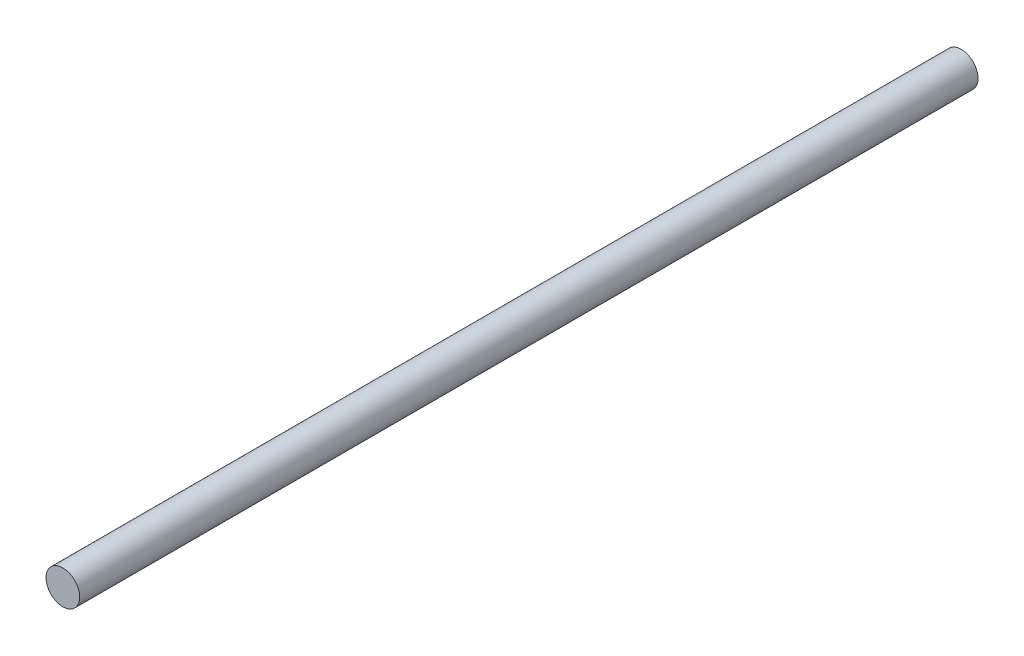
ISO-10303-21;
HEADER;
FILE_DESCRIPTION(('STEP AP214'),'2;1');
FILE_NAME('part.step','',(''),(''),'','','');
FILE_SCHEMA(('AUTOMOTIVE_DESIGN { 1 0 10303 214 1 1 1 1 }'));
ENDSEC;
DATA;
#1=APPLICATION_CONTEXT('core data for automotive mechanical design processes');
#2=APPLICATION_PROTOCOL_DEFINITION('international standard','automotive_design',2000,#1);
#3=PRODUCT_CONTEXT('',#1,'mechanical');
#4=PRODUCT('Part','Part','',(#3));
#5=PRODUCT_RELATED_PRODUCT_CATEGORY('part','',(#4));
#6=PRODUCT_DEFINITION_FORMATION('','',#4);
#7=PRODUCT_DEFINITION_CONTEXT('part definition',#1,'design');
#8=PRODUCT_DEFINITION('design','',#6,#7);
#9=PRODUCT_DEFINITION_SHAPE('','',#8);
#10=(LENGTH_UNIT() NAMED_UNIT(*) SI_UNIT(.MILLI.,.METRE.));
#11=(NAMED_UNIT(*) PLANE_ANGLE_UNIT() SI_UNIT($,.RADIAN.));
#12=(NAMED_UNIT(*) SI_UNIT($,.STERADIAN.) SOLID_ANGLE_UNIT());
#13=UNCERTAINTY_MEASURE_WITH_UNIT(LENGTH_MEASURE(1.E-05),#10,'distance_accuracy_value','');
#14=(GEOMETRIC_REPRESENTATION_CONTEXT(3) GLOBAL_UNCERTAINTY_ASSIGNED_CONTEXT((#13)) GLOBAL_UNIT_ASSIGNED_CONTEXT((#10,
#11,#12)) REPRESENTATION_CONTEXT('',''));
#15=CARTESIAN_POINT('',(0.,0.,0.));
#16=DIRECTION('',(0.,0.,1.));
#17=DIRECTION('',(1.,0.,0.));
#18=AXIS2_PLACEMENT_3D('',#15,#16,#17);
#19=CARTESIAN_POINT('',(0.,-2.5,-15.));
#20=DIRECTION('',(0.,0.,-1.));
#21=DIRECTION('',(-1.,0.,0.));
#22=AXIS2_PLACEMENT_3D('',#19,#20,#21);
#23=PLANE('',#22);
#24=CARTESIAN_POINT('',(0.,-2.5,-15.));
#25=DIRECTION('',(0.,0.,-1.));
#26=DIRECTION('',(-1.,0.,0.));
#27=AXIS2_PLACEMENT_3D('',#24,#25,#26);
#28=CIRCLE('',#27,0.3);
#29=CARTESIAN_POINT('',(-0.3,-2.5,-15.));
#30=VERTEX_POINT('',#29);
#31=EDGE_CURVE('E18',#30,#30,#28,.F.);
#32=ORIENTED_EDGE('',*,*,#31,.F.);
#33=EDGE_LOOP('',(#32));
#34=FACE_BOUND('',#33,.T.);
#35=ADVANCED_FACE('F15',(#34),#23,.T.);
#36=CARTESIAN_POINT('',(0.,-2.5,1.));
#37=DIRECTION('',(0.,0.,-1.));
#38=DIRECTION('',(-1.,0.,0.));
#39=AXIS2_PLACEMENT_3D('',#36,#37,#38);
#40=PLANE('',#39);
#41=CARTESIAN_POINT('',(0.,-2.5,1.));
#42=DIRECTION('',(0.,0.,-1.));
#43=DIRECTION('',(-1.,0.,0.));
#44=AXIS2_PLACEMENT_3D('',#41,#42,#43);
#45=CIRCLE('',#44,0.3);
#46=CARTESIAN_POINT('',(-0.3,-2.5,1.));
#47=VERTEX_POINT('',#46);
#48=EDGE_CURVE('E10',#47,#47,#45,.T.);
#49=ORIENTED_EDGE('',*,*,#48,.F.);
#50=EDGE_LOOP('',(#49));
#51=FACE_BOUND('',#50,.T.);
#52=ADVANCED_FACE('F30',(#51),#40,.F.);
#53=CARTESIAN_POINT('',(0.,-2.5,-15.));
#54=DIRECTION('',(0.,0.,-1.));
#55=DIRECTION('',(-1.,0.,0.));
#56=AXIS2_PLACEMENT_3D('',#53,#54,#55);
#57=CYLINDRICAL_SURFACE('',#56,0.3);
#58=ORIENTED_EDGE('',*,*,#31,.T.);
#59=EDGE_LOOP('',(#58));
#60=FACE_BOUND('',#59,.T.);
#61=ORIENTED_EDGE('',*,*,#48,.T.);
#62=EDGE_LOOP('',(#61));
#63=FACE_BOUND('',#62,.T.);
#64=ADVANCED_FACE('F27',(#60,#63),#57,.T.);
#65=CLOSED_SHELL('',(#35,#52,#64));
#66=MANIFOLD_SOLID_BREP('B1',#65);
#67=ADVANCED_BREP_SHAPE_REPRESENTATION('',(#18,#66),#14);
#68=SHAPE_DEFINITION_REPRESENTATION(#9,#67);
ENDSEC;
END-ISO-10303-21;
